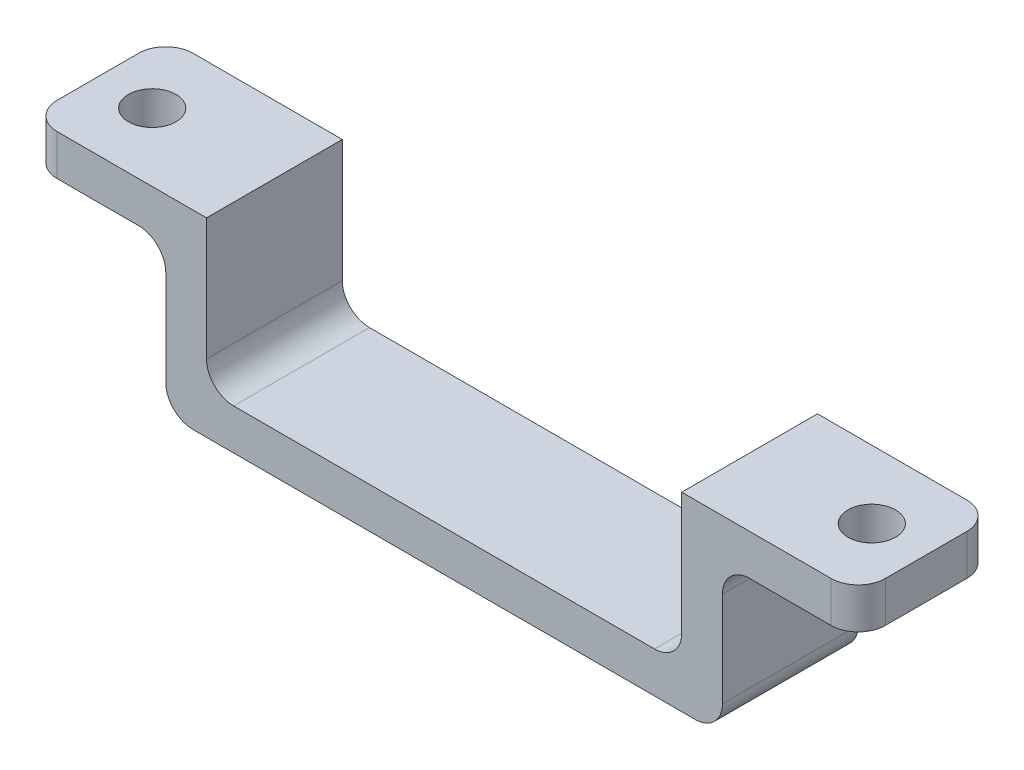
ISO-10303-21;
HEADER;
FILE_DESCRIPTION(('STEP AP214'),'2;1');
FILE_NAME('part.step','',(''),(''),'','','');
FILE_SCHEMA(('AUTOMOTIVE_DESIGN { 1 0 10303 214 1 1 1 1 }'));
ENDSEC;
DATA;
#1=APPLICATION_CONTEXT('core data for automotive mechanical design processes');
#2=APPLICATION_PROTOCOL_DEFINITION('international standard','automotive_design',2000,#1);
#3=PRODUCT_CONTEXT('',#1,'mechanical');
#4=PRODUCT('Part','Part','',(#3));
#5=PRODUCT_RELATED_PRODUCT_CATEGORY('part','',(#4));
#6=PRODUCT_DEFINITION_FORMATION('','',#4);
#7=PRODUCT_DEFINITION_CONTEXT('part definition',#1,'design');
#8=PRODUCT_DEFINITION('design','',#6,#7);
#9=PRODUCT_DEFINITION_SHAPE('','',#8);
#10=(LENGTH_UNIT() NAMED_UNIT(*) SI_UNIT(.MILLI.,.METRE.));
#11=(NAMED_UNIT(*) PLANE_ANGLE_UNIT() SI_UNIT($,.RADIAN.));
#12=(NAMED_UNIT(*) SI_UNIT($,.STERADIAN.) SOLID_ANGLE_UNIT());
#13=UNCERTAINTY_MEASURE_WITH_UNIT(LENGTH_MEASURE(1.E-05),#10,'distance_accuracy_value','');
#14=(GEOMETRIC_REPRESENTATION_CONTEXT(3) GLOBAL_UNCERTAINTY_ASSIGNED_CONTEXT((#13)) GLOBAL_UNIT_ASSIGNED_CONTEXT((#10,
#11,#12)) REPRESENTATION_CONTEXT('',''));
#15=CARTESIAN_POINT('',(0.,0.,0.));
#16=DIRECTION('',(0.,0.,1.));
#17=DIRECTION('',(1.,0.,0.));
#18=AXIS2_PLACEMENT_3D('',#15,#16,#17);
#19=CARTESIAN_POINT('',(17.5,-3.,5.));
#20=DIRECTION('',(0.,1.,0.));
#21=DIRECTION('',(-1.,0.,0.));
#22=AXIS2_PLACEMENT_3D('',#19,#20,#21);
#23=PLANE('',#22);
#24=CARTESIAN_POINT('',(26.5,-3.,0.));
#25=DIRECTION('',(0.,-1.,0.));
#26=DIRECTION('',(0.,0.,-1.));
#27=AXIS2_PLACEMENT_3D('',#24,#25,#26);
#28=CIRCLE('',#27,1.75);
#29=CARTESIAN_POINT('',(26.5,-3.,-1.75));
#30=VERTEX_POINT('',#29);
#31=EDGE_CURVE('E657',#30,#30,#28,.T.);
#32=ORIENTED_EDGE('',*,*,#31,.F.);
#33=EDGE_LOOP('',(#32));
#34=FACE_BOUND('',#33,.T.);
#35=DIRECTION('',(0.,0.,-1.));
#36=VECTOR('',#35,1.);
#37=CARTESIAN_POINT('',(30.5,-3.,5.));
#38=LINE('',#37,#36);
#39=CARTESIAN_POINT('',(30.5,-3.,3.));
#40=VERTEX_POINT('',#39);
#41=CARTESIAN_POINT('',(30.5,-3.,-3.));
#42=VERTEX_POINT('',#41);
#43=EDGE_CURVE('E266',#40,#42,#38,.T.);
#44=ORIENTED_EDGE('',*,*,#43,.F.);
#45=CARTESIAN_POINT('',(28.5,-3.,3.));
#46=DIRECTION('',(0.,1.,0.));
#47=DIRECTION('',(-1.,0.,0.));
#48=AXIS2_PLACEMENT_3D('',#45,#46,#47);
#49=CIRCLE('',#48,2.);
#50=CARTESIAN_POINT('',(28.5,-3.,5.));
#51=VERTEX_POINT('',#50);
#52=EDGE_CURVE('E331',#40,#51,#49,.F.);
#53=ORIENTED_EDGE('',*,*,#52,.T.);
#54=DIRECTION('',(1.,0.,0.));
#55=VECTOR('',#54,1.);
#56=CARTESIAN_POINT('',(17.5,-3.,5.));
#57=LINE('',#56,#55);
#58=CARTESIAN_POINT('',(22.5,-3.,5.));
#59=VERTEX_POINT('',#58);
#60=EDGE_CURVE('E209',#59,#51,#57,.T.);
#61=ORIENTED_EDGE('',*,*,#60,.F.);
#62=DIRECTION('',(0.,0.,-1.));
#63=VECTOR('',#62,1.);
#64=CARTESIAN_POINT('',(22.5,-3.,-5.));
#65=LINE('',#64,#63);
#66=CARTESIAN_POINT('',(22.5,-3.,-5.));
#67=VERTEX_POINT('',#66);
#68=EDGE_CURVE('E277',#59,#67,#65,.T.);
#69=ORIENTED_EDGE('',*,*,#68,.T.);
#70=DIRECTION('',(1.,0.,0.));
#71=VECTOR('',#70,1.);
#72=CARTESIAN_POINT('',(17.5,-3.,-5.));
#73=LINE('',#72,#71);
#74=CARTESIAN_POINT('',(28.5,-3.,-5.));
#75=VERTEX_POINT('',#74);
#76=EDGE_CURVE('E234',#67,#75,#73,.T.);
#77=ORIENTED_EDGE('',*,*,#76,.T.);
#78=CARTESIAN_POINT('',(28.5,-3.,-3.));
#79=DIRECTION('',(0.,1.,0.));
#80=DIRECTION('',(-1.,0.,0.));
#81=AXIS2_PLACEMENT_3D('',#78,#79,#80);
#82=CIRCLE('',#81,2.);
#83=EDGE_CURVE('E329',#75,#42,#82,.F.);
#84=ORIENTED_EDGE('',*,*,#83,.T.);
#85=EDGE_LOOP('',(#44,#53,#61,#69,#77,#84));
#86=FACE_BOUND('',#85,.T.);
#87=ADVANCED_FACE('F33',(#34,#86),#23,.F.);
#88=CARTESIAN_POINT('',(30.5,0.,5.));
#89=DIRECTION('',(1.,0.,0.));
#90=DIRECTION('',(0.,0.,-1.));
#91=AXIS2_PLACEMENT_3D('',#88,#89,#90);
#92=PLANE('',#91);
#93=DIRECTION('',(0.,0.,-1.));
#94=VECTOR('',#93,1.);
#95=CARTESIAN_POINT('',(30.5,0.,5.));
#96=LINE('',#95,#94);
#97=CARTESIAN_POINT('',(30.5,0.,3.));
#98=VERTEX_POINT('',#97);
#99=CARTESIAN_POINT('',(30.5,0.,-3.));
#100=VERTEX_POINT('',#99);
#101=EDGE_CURVE('E202',#98,#100,#96,.T.);
#102=ORIENTED_EDGE('',*,*,#101,.F.);
#103=DIRECTION('',(0.,-1.,0.));
#104=VECTOR('',#103,1.);
#105=CARTESIAN_POINT('',(30.5,-3.,3.));
#106=LINE('',#105,#104);
#107=EDGE_CURVE('E326',#98,#40,#106,.T.);
#108=ORIENTED_EDGE('',*,*,#107,.T.);
#109=ORIENTED_EDGE('',*,*,#43,.T.);
#110=DIRECTION('',(0.,-1.,0.));
#111=VECTOR('',#110,1.);
#112=CARTESIAN_POINT('',(30.5,0.,-3.));
#113=LINE('',#112,#111);
#114=EDGE_CURVE('E324',#42,#100,#113,.F.);
#115=ORIENTED_EDGE('',*,*,#114,.T.);
#116=EDGE_LOOP('',(#102,#108,#109,#115));
#117=FACE_BOUND('',#116,.T.);
#118=ADVANCED_FACE('F410',(#117),#92,.T.);
#119=CARTESIAN_POINT('',(17.5,0.,5.));
#120=DIRECTION('',(0.,1.,0.));
#121=DIRECTION('',(-1.,0.,0.));
#122=AXIS2_PLACEMENT_3D('',#119,#120,#121);
#123=PLANE('',#122);
#124=CARTESIAN_POINT('',(26.5,0.,0.));
#125=DIRECTION('',(0.,-1.,0.));
#126=DIRECTION('',(0.,0.,-1.));
#127=AXIS2_PLACEMENT_3D('',#124,#125,#126);
#128=CIRCLE('',#127,1.75);
#129=CARTESIAN_POINT('',(26.5,0.,-1.75));
#130=VERTEX_POINT('',#129);
#131=EDGE_CURVE('E237',#130,#130,#128,.T.);
#132=ORIENTED_EDGE('',*,*,#131,.T.);
#133=EDGE_LOOP('',(#132));
#134=FACE_BOUND('',#133,.T.);
#135=DIRECTION('',(1.,0.,0.));
#136=VECTOR('',#135,1.);
#137=CARTESIAN_POINT('',(17.5,0.,5.));
#138=LINE('',#137,#136);
#139=CARTESIAN_POINT('',(17.5,0.,5.));
#140=VERTEX_POINT('',#139);
#141=CARTESIAN_POINT('',(28.5,0.,5.));
#142=VERTEX_POINT('',#141);
#143=EDGE_CURVE('E194',#140,#142,#138,.T.);
#144=ORIENTED_EDGE('',*,*,#143,.T.);
#145=CARTESIAN_POINT('',(28.5,0.,3.));
#146=DIRECTION('',(0.,1.,0.));
#147=DIRECTION('',(-1.,0.,0.));
#148=AXIS2_PLACEMENT_3D('',#145,#146,#147);
#149=CIRCLE('',#148,2.);
#150=EDGE_CURVE('E338',#142,#98,#149,.T.);
#151=ORIENTED_EDGE('',*,*,#150,.T.);
#152=ORIENTED_EDGE('',*,*,#101,.T.);
#153=CARTESIAN_POINT('',(28.5,0.,-3.));
#154=DIRECTION('',(0.,1.,0.));
#155=DIRECTION('',(-1.,0.,0.));
#156=AXIS2_PLACEMENT_3D('',#153,#154,#155);
#157=CIRCLE('',#156,2.);
#158=CARTESIAN_POINT('',(28.5,0.,-5.));
#159=VERTEX_POINT('',#158);
#160=EDGE_CURVE('E336',#100,#159,#157,.T.);
#161=ORIENTED_EDGE('',*,*,#160,.T.);
#162=DIRECTION('',(1.,0.,0.));
#163=VECTOR('',#162,1.);
#164=CARTESIAN_POINT('',(17.5,0.,-5.));
#165=LINE('',#164,#163);
#166=CARTESIAN_POINT('',(17.5,0.,-5.));
#167=VERTEX_POINT('',#166);
#168=EDGE_CURVE('E201',#167,#159,#165,.T.);
#169=ORIENTED_EDGE('',*,*,#168,.F.);
#170=DIRECTION('',(0.,0.,-1.));
#171=VECTOR('',#170,1.);
#172=CARTESIAN_POINT('',(17.5,0.,5.));
#173=LINE('',#172,#171);
#174=EDGE_CURVE('E186',#140,#167,#173,.T.);
#175=ORIENTED_EDGE('',*,*,#174,.F.);
#176=EDGE_LOOP('',(#144,#151,#152,#161,#169,#175));
#177=FACE_BOUND('',#176,.T.);
#178=ADVANCED_FACE('F198',(#134,#177),#123,.T.);
#179=CARTESIAN_POINT('',(17.5,-11.,5.));
#180=DIRECTION('',(-1.,0.,0.));
#181=DIRECTION('',(0.,0.,1.));
#182=AXIS2_PLACEMENT_3D('',#179,#180,#181);
#183=PLANE('',#182);
#184=DIRECTION('',(0.,1.,0.));
#185=VECTOR('',#184,1.);
#186=CARTESIAN_POINT('',(17.5,-11.,-5.));
#187=LINE('',#186,#185);
#188=CARTESIAN_POINT('',(17.5,-9.,-5.));
#189=VERTEX_POINT('',#188);
#190=EDGE_CURVE('E239',#189,#167,#187,.T.);
#191=ORIENTED_EDGE('',*,*,#190,.F.);
#192=DIRECTION('',(0.,0.,-1.));
#193=VECTOR('',#192,1.);
#194=CARTESIAN_POINT('',(17.5,-9.,5.));
#195=LINE('',#194,#193);
#196=CARTESIAN_POINT('',(17.5,-9.,5.));
#197=VERTEX_POINT('',#196);
#198=EDGE_CURVE('E189',#189,#197,#195,.F.);
#199=ORIENTED_EDGE('',*,*,#198,.T.);
#200=DIRECTION('',(0.,1.,0.));
#201=VECTOR('',#200,1.);
#202=CARTESIAN_POINT('',(17.5,-11.,5.));
#203=LINE('',#202,#201);
#204=EDGE_CURVE('E182',#197,#140,#203,.T.);
#205=ORIENTED_EDGE('',*,*,#204,.T.);
#206=ORIENTED_EDGE('',*,*,#174,.T.);
#207=EDGE_LOOP('',(#191,#199,#205,#206));
#208=FACE_BOUND('',#207,.T.);
#209=ADVANCED_FACE('F185',(#208),#183,.T.);
#210=CARTESIAN_POINT('',(-17.5,-11.,5.));
#211=DIRECTION('',(0.,1.,0.));
#212=DIRECTION('',(-1.,0.,0.));
#213=AXIS2_PLACEMENT_3D('',#210,#211,#212);
#214=PLANE('',#213);
#215=DIRECTION('',(1.,0.,0.));
#216=VECTOR('',#215,1.);
#217=CARTESIAN_POINT('',(-17.5,-11.,5.));
#218=LINE('',#217,#216);
#219=CARTESIAN_POINT('',(-15.5,-11.,5.));
#220=VERTEX_POINT('',#219);
#221=CARTESIAN_POINT('',(15.5,-11.,5.));
#222=VERTEX_POINT('',#221);
#223=EDGE_CURVE('E193',#220,#222,#218,.T.);
#224=ORIENTED_EDGE('',*,*,#223,.T.);
#225=DIRECTION('',(0.,0.,-1.));
#226=VECTOR('',#225,1.);
#227=CARTESIAN_POINT('',(15.5,-11.,-5.));
#228=LINE('',#227,#226);
#229=CARTESIAN_POINT('',(15.5,-11.,-5.));
#230=VERTEX_POINT('',#229);
#231=EDGE_CURVE('E300',#222,#230,#228,.T.);
#232=ORIENTED_EDGE('',*,*,#231,.T.);
#233=DIRECTION('',(1.,0.,0.));
#234=VECTOR('',#233,1.);
#235=CARTESIAN_POINT('',(-17.5,-11.,-5.));
#236=LINE('',#235,#234);
#237=CARTESIAN_POINT('',(-15.5,-11.,-5.));
#238=VERTEX_POINT('',#237);
#239=EDGE_CURVE('E241',#238,#230,#236,.T.);
#240=ORIENTED_EDGE('',*,*,#239,.F.);
#241=DIRECTION('',(0.,0.,-1.));
#242=VECTOR('',#241,1.);
#243=CARTESIAN_POINT('',(-15.5,-11.,5.));
#244=LINE('',#243,#242);
#245=EDGE_CURVE('E298',#238,#220,#244,.F.);
#246=ORIENTED_EDGE('',*,*,#245,.T.);
#247=EDGE_LOOP('',(#224,#232,#240,#246));
#248=FACE_BOUND('',#247,.T.);
#249=ADVANCED_FACE('F422',(#248),#214,.T.);
#250=CARTESIAN_POINT('',(-17.5,0.,5.));
#251=DIRECTION('',(1.,0.,0.));
#252=DIRECTION('',(0.,0.,-1.));
#253=AXIS2_PLACEMENT_3D('',#250,#251,#252);
#254=PLANE('',#253);
#255=DIRECTION('',(0.,-1.,0.));
#256=VECTOR('',#255,1.);
#257=CARTESIAN_POINT('',(-17.5,0.,5.));
#258=LINE('',#257,#256);
#259=CARTESIAN_POINT('',(-17.5,0.,5.));
#260=VERTEX_POINT('',#259);
#261=CARTESIAN_POINT('',(-17.5,-9.,5.));
#262=VERTEX_POINT('',#261);
#263=EDGE_CURVE('E217',#260,#262,#258,.T.);
#264=ORIENTED_EDGE('',*,*,#263,.T.);
#265=DIRECTION('',(0.,0.,-1.));
#266=VECTOR('',#265,1.);
#267=CARTESIAN_POINT('',(-17.5,-9.,-5.));
#268=LINE('',#267,#266);
#269=CARTESIAN_POINT('',(-17.5,-9.,-5.));
#270=VERTEX_POINT('',#269);
#271=EDGE_CURVE('E304',#262,#270,#268,.T.);
#272=ORIENTED_EDGE('',*,*,#271,.T.);
#273=DIRECTION('',(0.,-1.,0.));
#274=VECTOR('',#273,1.);
#275=CARTESIAN_POINT('',(-17.5,0.,-5.));
#276=LINE('',#275,#274);
#277=CARTESIAN_POINT('',(-17.5,0.,-5.));
#278=VERTEX_POINT('',#277);
#279=EDGE_CURVE('E244',#278,#270,#276,.T.);
#280=ORIENTED_EDGE('',*,*,#279,.F.);
#281=DIRECTION('',(0.,0.,-1.));
#282=VECTOR('',#281,1.);
#283=CARTESIAN_POINT('',(-17.5,0.,5.));
#284=LINE('',#283,#282);
#285=EDGE_CURVE('E203',#260,#278,#284,.T.);
#286=ORIENTED_EDGE('',*,*,#285,.F.);
#287=EDGE_LOOP('',(#264,#272,#280,#286));
#288=FACE_BOUND('',#287,.T.);
#289=ADVANCED_FACE('F431',(#288),#254,.T.);
#290=CARTESIAN_POINT('',(-30.5,0.,5.));
#291=DIRECTION('',(0.,1.,0.));
#292=DIRECTION('',(-1.,0.,0.));
#293=AXIS2_PLACEMENT_3D('',#290,#291,#292);
#294=PLANE('',#293);
#295=CARTESIAN_POINT('',(-26.5,0.,0.));
#296=DIRECTION('',(0.,-1.,0.));
#297=DIRECTION('',(0.,0.,-1.));
#298=AXIS2_PLACEMENT_3D('',#295,#296,#297);
#299=CIRCLE('',#298,1.75);
#300=CARTESIAN_POINT('',(-26.5,0.,-1.75000000000001));
#301=VERTEX_POINT('',#300);
#302=EDGE_CURVE('E652',#301,#301,#299,.T.);
#303=ORIENTED_EDGE('',*,*,#302,.T.);
#304=EDGE_LOOP('',(#303));
#305=FACE_BOUND('',#304,.T.);
#306=DIRECTION('',(1.,0.,0.));
#307=VECTOR('',#306,1.);
#308=CARTESIAN_POINT('',(-30.5,0.,-5.));
#309=LINE('',#308,#307);
#310=CARTESIAN_POINT('',(-28.5,0.,-5.));
#311=VERTEX_POINT('',#310);
#312=EDGE_CURVE('E247',#311,#278,#309,.T.);
#313=ORIENTED_EDGE('',*,*,#312,.F.);
#314=CARTESIAN_POINT('',(-28.5,0.,-3.));
#315=DIRECTION('',(0.,1.,0.));
#316=DIRECTION('',(-1.,0.,0.));
#317=AXIS2_PLACEMENT_3D('',#314,#315,#316);
#318=CIRCLE('',#317,2.);
#319=CARTESIAN_POINT('',(-30.5,0.,-3.));
#320=VERTEX_POINT('',#319);
#321=EDGE_CURVE('E348',#311,#320,#318,.T.);
#322=ORIENTED_EDGE('',*,*,#321,.T.);
#323=DIRECTION('',(0.,0.,-1.));
#324=VECTOR('',#323,1.);
#325=CARTESIAN_POINT('',(-30.5,0.,5.));
#326=LINE('',#325,#324);
#327=CARTESIAN_POINT('',(-30.5,0.,3.));
#328=VERTEX_POINT('',#327);
#329=EDGE_CURVE('E260',#328,#320,#326,.T.);
#330=ORIENTED_EDGE('',*,*,#329,.F.);
#331=CARTESIAN_POINT('',(-28.5,0.,3.));
#332=DIRECTION('',(0.,1.,0.));
#333=DIRECTION('',(-1.,0.,0.));
#334=AXIS2_PLACEMENT_3D('',#331,#332,#333);
#335=CIRCLE('',#334,2.);
#336=CARTESIAN_POINT('',(-28.5,0.,5.));
#337=VERTEX_POINT('',#336);
#338=EDGE_CURVE('E346',#328,#337,#335,.T.);
#339=ORIENTED_EDGE('',*,*,#338,.T.);
#340=DIRECTION('',(1.,0.,0.));
#341=VECTOR('',#340,1.);
#342=CARTESIAN_POINT('',(-30.5,0.,5.));
#343=LINE('',#342,#341);
#344=EDGE_CURVE('E220',#337,#260,#343,.T.);
#345=ORIENTED_EDGE('',*,*,#344,.T.);
#346=ORIENTED_EDGE('',*,*,#285,.T.);
#347=EDGE_LOOP('',(#313,#322,#330,#339,#345,#346));
#348=FACE_BOUND('',#347,.T.);
#349=ADVANCED_FACE('F359',(#305,#348),#294,.T.);
#350=CARTESIAN_POINT('',(-30.5,-3.,5.));
#351=DIRECTION('',(-1.,0.,0.));
#352=DIRECTION('',(0.,0.,1.));
#353=AXIS2_PLACEMENT_3D('',#350,#351,#352);
#354=PLANE('',#353);
#355=ORIENTED_EDGE('',*,*,#329,.T.);
#356=DIRECTION('',(0.,1.,0.));
#357=VECTOR('',#356,1.);
#358=CARTESIAN_POINT('',(-30.5,-3.,-3.));
#359=LINE('',#358,#357);
#360=CARTESIAN_POINT('',(-30.5,-3.,-3.));
#361=VERTEX_POINT('',#360);
#362=EDGE_CURVE('E48',#320,#361,#359,.F.);
#363=ORIENTED_EDGE('',*,*,#362,.T.);
#364=DIRECTION('',(0.,0.,-1.));
#365=VECTOR('',#364,1.);
#366=CARTESIAN_POINT('',(-30.5,-3.,5.));
#367=LINE('',#366,#365);
#368=CARTESIAN_POINT('',(-30.5,-3.,3.));
#369=VERTEX_POINT('',#368);
#370=EDGE_CURVE('E233',#369,#361,#367,.T.);
#371=ORIENTED_EDGE('',*,*,#370,.F.);
#372=DIRECTION('',(0.,1.,0.));
#373=VECTOR('',#372,1.);
#374=CARTESIAN_POINT('',(-30.5,0.,3.));
#375=LINE('',#374,#373);
#376=EDGE_CURVE('E350',#369,#328,#375,.T.);
#377=ORIENTED_EDGE('',*,*,#376,.T.);
#378=EDGE_LOOP('',(#355,#363,#371,#377));
#379=FACE_BOUND('',#378,.T.);
#380=ADVANCED_FACE('F355',(#379),#354,.T.);
#381=CARTESIAN_POINT('',(-30.5,-3.,5.));
#382=DIRECTION('',(0.,1.,0.));
#383=DIRECTION('',(-1.,0.,0.));
#384=AXIS2_PLACEMENT_3D('',#381,#382,#383);
#385=PLANE('',#384);
#386=CARTESIAN_POINT('',(-26.5,-3.,0.));
#387=DIRECTION('',(0.,-1.,0.));
#388=DIRECTION('',(0.,0.,-1.));
#389=AXIS2_PLACEMENT_3D('',#386,#387,#388);
#390=CIRCLE('',#389,1.75);
#391=CARTESIAN_POINT('',(-26.5,-3.,-1.75000000000001));
#392=VERTEX_POINT('',#391);
#393=EDGE_CURVE('E655',#392,#392,#390,.T.);
#394=ORIENTED_EDGE('',*,*,#393,.F.);
#395=EDGE_LOOP('',(#394));
#396=FACE_BOUND('',#395,.T.);
#397=ORIENTED_EDGE('',*,*,#370,.T.);
#398=CARTESIAN_POINT('',(-28.5,-3.,-3.));
#399=DIRECTION('',(0.,1.,0.));
#400=DIRECTION('',(-1.,0.,0.));
#401=AXIS2_PLACEMENT_3D('',#398,#399,#400);
#402=CIRCLE('',#401,2.);
#403=CARTESIAN_POINT('',(-28.5,-3.,-5.));
#404=VERTEX_POINT('',#403);
#405=EDGE_CURVE('E11',#361,#404,#402,.F.);
#406=ORIENTED_EDGE('',*,*,#405,.T.);
#407=DIRECTION('',(1.,0.,0.));
#408=VECTOR('',#407,1.);
#409=CARTESIAN_POINT('',(-30.5,-3.,-5.));
#410=LINE('',#409,#408);
#411=CARTESIAN_POINT('',(-22.5,-3.,-5.));
#412=VERTEX_POINT('',#411);
#413=EDGE_CURVE('E249',#404,#412,#410,.T.);
#414=ORIENTED_EDGE('',*,*,#413,.T.);
#415=DIRECTION('',(0.,0.,-1.));
#416=VECTOR('',#415,1.);
#417=CARTESIAN_POINT('',(-22.5,-3.,5.));
#418=LINE('',#417,#416);
#419=CARTESIAN_POINT('',(-22.5,-3.,5.));
#420=VERTEX_POINT('',#419);
#421=EDGE_CURVE('E274',#412,#420,#418,.F.);
#422=ORIENTED_EDGE('',*,*,#421,.T.);
#423=DIRECTION('',(1.,0.,0.));
#424=VECTOR('',#423,1.);
#425=CARTESIAN_POINT('',(-30.5,-3.,5.));
#426=LINE('',#425,#424);
#427=CARTESIAN_POINT('',(-28.5,-3.,5.));
#428=VERTEX_POINT('',#427);
#429=EDGE_CURVE('E222',#428,#420,#426,.T.);
#430=ORIENTED_EDGE('',*,*,#429,.F.);
#431=CARTESIAN_POINT('',(-28.5,-3.,3.));
#432=DIRECTION('',(0.,1.,0.));
#433=DIRECTION('',(-1.,0.,0.));
#434=AXIS2_PLACEMENT_3D('',#431,#432,#433);
#435=CIRCLE('',#434,2.);
#436=EDGE_CURVE('E41',#428,#369,#435,.F.);
#437=ORIENTED_EDGE('',*,*,#436,.T.);
#438=EDGE_LOOP('',(#397,#406,#414,#422,#430,#437));
#439=FACE_BOUND('',#438,.T.);
#440=ADVANCED_FACE('F370',(#396,#439),#385,.F.);
#441=CARTESIAN_POINT('',(-20.5,0.,5.));
#442=DIRECTION('',(1.,0.,0.));
#443=DIRECTION('',(0.,0.,-1.));
#444=AXIS2_PLACEMENT_3D('',#441,#442,#443);
#445=PLANE('',#444);
#446=DIRECTION('',(0.,1.,0.));
#447=VECTOR('',#446,1.);
#448=CARTESIAN_POINT('',(-20.5,0.,5.));
#449=LINE('',#448,#447);
#450=CARTESIAN_POINT('',(-20.5,-5.,5.));
#451=VERTEX_POINT('',#450);
#452=CARTESIAN_POINT('',(-20.5,-12.,5.));
#453=VERTEX_POINT('',#452);
#454=EDGE_CURVE('E224',#451,#453,#449,.F.);
#455=ORIENTED_EDGE('',*,*,#454,.F.);
#456=DIRECTION('',(0.,0.,-1.));
#457=VECTOR('',#456,1.);
#458=CARTESIAN_POINT('',(-20.5,-5.,-5.));
#459=LINE('',#458,#457);
#460=CARTESIAN_POINT('',(-20.5,-5.,-5.));
#461=VERTEX_POINT('',#460);
#462=EDGE_CURVE('E271',#451,#461,#459,.T.);
#463=ORIENTED_EDGE('',*,*,#462,.T.);
#464=DIRECTION('',(0.,1.,0.));
#465=VECTOR('',#464,1.);
#466=CARTESIAN_POINT('',(-20.5,0.,-5.));
#467=LINE('',#466,#465);
#468=CARTESIAN_POINT('',(-20.5,-12.,-5.));
#469=VERTEX_POINT('',#468);
#470=EDGE_CURVE('E251',#461,#469,#467,.F.);
#471=ORIENTED_EDGE('',*,*,#470,.T.);
#472=DIRECTION('',(0.,0.,-1.));
#473=VECTOR('',#472,1.);
#474=CARTESIAN_POINT('',(-20.5,-12.,5.));
#475=LINE('',#474,#473);
#476=EDGE_CURVE('E269',#469,#453,#475,.F.);
#477=ORIENTED_EDGE('',*,*,#476,.T.);
#478=EDGE_LOOP('',(#455,#463,#471,#477));
#479=FACE_BOUND('',#478,.T.);
#480=ADVANCED_FACE('F378',(#479),#445,.F.);
#481=CARTESIAN_POINT('',(-17.5,-14.,5.));
#482=DIRECTION('',(0.,1.,0.));
#483=DIRECTION('',(-1.,0.,0.));
#484=AXIS2_PLACEMENT_3D('',#481,#482,#483);
#485=PLANE('',#484);
#486=DIRECTION('',(1.,0.,0.));
#487=VECTOR('',#486,1.);
#488=CARTESIAN_POINT('',(-17.5,-14.,-5.));
#489=LINE('',#488,#487);
#490=CARTESIAN_POINT('',(-18.5,-14.,-5.));
#491=VERTEX_POINT('',#490);
#492=CARTESIAN_POINT('',(18.5,-14.,-5.));
#493=VERTEX_POINT('',#492);
#494=EDGE_CURVE('E254',#491,#493,#489,.T.);
#495=ORIENTED_EDGE('',*,*,#494,.T.);
#496=DIRECTION('',(0.,0.,-1.));
#497=VECTOR('',#496,1.);
#498=CARTESIAN_POINT('',(18.5,-14.,5.));
#499=LINE('',#498,#497);
#500=CARTESIAN_POINT('',(18.5,-14.,5.));
#501=VERTEX_POINT('',#500);
#502=EDGE_CURVE('E292',#493,#501,#499,.F.);
#503=ORIENTED_EDGE('',*,*,#502,.T.);
#504=DIRECTION('',(1.,0.,0.));
#505=VECTOR('',#504,1.);
#506=CARTESIAN_POINT('',(-17.5,-14.,5.));
#507=LINE('',#506,#505);
#508=CARTESIAN_POINT('',(-18.5,-14.,5.));
#509=VERTEX_POINT('',#508);
#510=EDGE_CURVE('E227',#509,#501,#507,.T.);
#511=ORIENTED_EDGE('',*,*,#510,.F.);
#512=DIRECTION('',(0.,0.,-1.));
#513=VECTOR('',#512,1.);
#514=CARTESIAN_POINT('',(-18.5,-14.,5.));
#515=LINE('',#514,#513);
#516=EDGE_CURVE('E289',#509,#491,#515,.T.);
#517=ORIENTED_EDGE('',*,*,#516,.T.);
#518=EDGE_LOOP('',(#495,#503,#511,#517));
#519=FACE_BOUND('',#518,.T.);
#520=ADVANCED_FACE('F386',(#519),#485,.F.);
#521=CARTESIAN_POINT('',(20.5,-11.,5.));
#522=DIRECTION('',(-1.,0.,0.));
#523=DIRECTION('',(0.,0.,1.));
#524=AXIS2_PLACEMENT_3D('',#521,#522,#523);
#525=PLANE('',#524);
#526=DIRECTION('',(0.,1.,0.));
#527=VECTOR('',#526,1.);
#528=CARTESIAN_POINT('',(20.5,-11.,-5.));
#529=LINE('',#528,#527);
#530=CARTESIAN_POINT('',(20.5,-12.,-5.));
#531=VERTEX_POINT('',#530);
#532=CARTESIAN_POINT('',(20.5,-5.,-5.));
#533=VERTEX_POINT('',#532);
#534=EDGE_CURVE('E211',#531,#533,#529,.T.);
#535=ORIENTED_EDGE('',*,*,#534,.T.);
#536=DIRECTION('',(0.,0.,-1.));
#537=VECTOR('',#536,1.);
#538=CARTESIAN_POINT('',(20.5,-5.,5.));
#539=LINE('',#538,#537);
#540=CARTESIAN_POINT('',(20.5,-5.,5.));
#541=VERTEX_POINT('',#540);
#542=EDGE_CURVE('E283',#533,#541,#539,.F.);
#543=ORIENTED_EDGE('',*,*,#542,.T.);
#544=DIRECTION('',(0.,1.,0.));
#545=VECTOR('',#544,1.);
#546=CARTESIAN_POINT('',(20.5,-11.,5.));
#547=LINE('',#546,#545);
#548=CARTESIAN_POINT('',(20.5,-12.,5.));
#549=VERTEX_POINT('',#548);
#550=EDGE_CURVE('E230',#549,#541,#547,.T.);
#551=ORIENTED_EDGE('',*,*,#550,.F.);
#552=DIRECTION('',(0.,0.,-1.));
#553=VECTOR('',#552,1.);
#554=CARTESIAN_POINT('',(20.5,-12.,5.));
#555=LINE('',#554,#553);
#556=EDGE_CURVE('E280',#549,#531,#555,.T.);
#557=ORIENTED_EDGE('',*,*,#556,.T.);
#558=EDGE_LOOP('',(#535,#543,#551,#557));
#559=FACE_BOUND('',#558,.T.);
#560=ADVANCED_FACE('F395',(#559),#525,.F.);
#561=CARTESIAN_POINT('',(0.,0.,5.));
#562=DIRECTION('',(0.,0.,-1.));
#563=DIRECTION('',(-1.,0.,0.));
#564=AXIS2_PLACEMENT_3D('',#561,#562,#563);
#565=PLANE('',#564);
#566=ORIENTED_EDGE('',*,*,#60,.T.);
#567=DIRECTION('',(0.,-1.,0.));
#568=VECTOR('',#567,1.);
#569=CARTESIAN_POINT('',(28.5,0.,5.));
#570=LINE('',#569,#568);
#571=EDGE_CURVE('E208',#51,#142,#570,.F.);
#572=ORIENTED_EDGE('',*,*,#571,.T.);
#573=ORIENTED_EDGE('',*,*,#143,.F.);
#574=ORIENTED_EDGE('',*,*,#204,.F.);
#575=CARTESIAN_POINT('',(15.5,-9.,5.));
#576=DIRECTION('',(0.,0.,-1.));
#577=DIRECTION('',(-1.,0.,0.));
#578=AXIS2_PLACEMENT_3D('',#575,#576,#577);
#579=CIRCLE('',#578,2.);
#580=EDGE_CURVE('E318',#197,#222,#579,.T.);
#581=ORIENTED_EDGE('',*,*,#580,.T.);
#582=ORIENTED_EDGE('',*,*,#223,.F.);
#583=CARTESIAN_POINT('',(-15.5,-9.,5.));
#584=DIRECTION('',(0.,0.,-1.));
#585=DIRECTION('',(-1.,0.,0.));
#586=AXIS2_PLACEMENT_3D('',#583,#584,#585);
#587=CIRCLE('',#586,2.);
#588=EDGE_CURVE('E322',#220,#262,#587,.T.);
#589=ORIENTED_EDGE('',*,*,#588,.T.);
#590=ORIENTED_EDGE('',*,*,#263,.F.);
#591=ORIENTED_EDGE('',*,*,#344,.F.);
#592=DIRECTION('',(0.,1.,0.));
#593=VECTOR('',#592,1.);
#594=CARTESIAN_POINT('',(-28.5,-3.,5.));
#595=LINE('',#594,#593);
#596=EDGE_CURVE('E333',#337,#428,#595,.F.);
#597=ORIENTED_EDGE('',*,*,#596,.T.);
#598=ORIENTED_EDGE('',*,*,#429,.T.);
#599=CARTESIAN_POINT('',(-22.5,-5.,5.));
#600=DIRECTION('',(0.,0.,-1.));
#601=DIRECTION('',(-1.,0.,0.));
#602=AXIS2_PLACEMENT_3D('',#599,#600,#601);
#603=CIRCLE('',#602,2.);
#604=EDGE_CURVE('E310',#420,#451,#603,.T.);
#605=ORIENTED_EDGE('',*,*,#604,.T.);
#606=ORIENTED_EDGE('',*,*,#454,.T.);
#607=CARTESIAN_POINT('',(-18.5,-12.,5.));
#608=DIRECTION('',(0.,0.,-1.));
#609=DIRECTION('',(-1.,0.,0.));
#610=AXIS2_PLACEMENT_3D('',#607,#608,#609);
#611=CIRCLE('',#610,2.);
#612=EDGE_CURVE('E294',#453,#509,#611,.F.);
#613=ORIENTED_EDGE('',*,*,#612,.T.);
#614=ORIENTED_EDGE('',*,*,#510,.T.);
#615=CARTESIAN_POINT('',(18.5,-12.,5.));
#616=DIRECTION('',(0.,0.,-1.));
#617=DIRECTION('',(-1.,0.,0.));
#618=AXIS2_PLACEMENT_3D('',#615,#616,#617);
#619=CIRCLE('',#618,2.);
#620=EDGE_CURVE('E296',#501,#549,#619,.F.);
#621=ORIENTED_EDGE('',*,*,#620,.T.);
#622=ORIENTED_EDGE('',*,*,#550,.T.);
#623=CARTESIAN_POINT('',(22.5,-5.,5.));
#624=DIRECTION('',(0.,0.,-1.));
#625=DIRECTION('',(-1.,0.,0.));
#626=AXIS2_PLACEMENT_3D('',#623,#624,#625);
#627=CIRCLE('',#626,2.);
#628=EDGE_CURVE('E314',#541,#59,#627,.T.);
#629=ORIENTED_EDGE('',*,*,#628,.T.);
#630=EDGE_LOOP('',(#566,#572,#573,#574,#581,#582,#589,#590,#591,#597,#598,#605,#606,#613,#614,
#621,#622,#629));
#631=FACE_BOUND('',#630,.T.);
#632=ADVANCED_FACE('F206',(#631),#565,.F.);
#633=CARTESIAN_POINT('',(0.,0.,-5.));
#634=DIRECTION('',(0.,0.,-1.));
#635=DIRECTION('',(-1.,0.,0.));
#636=AXIS2_PLACEMENT_3D('',#633,#634,#635);
#637=PLANE('',#636);
#638=ORIENTED_EDGE('',*,*,#168,.T.);
#639=DIRECTION('',(0.,-1.,0.));
#640=VECTOR('',#639,1.);
#641=CARTESIAN_POINT('',(28.5,0.,-5.));
#642=LINE('',#641,#640);
#643=EDGE_CURVE('E343',#159,#75,#642,.T.);
#644=ORIENTED_EDGE('',*,*,#643,.T.);
#645=ORIENTED_EDGE('',*,*,#76,.F.);
#646=CARTESIAN_POINT('',(22.5,-5.,-5.));
#647=DIRECTION('',(0.,0.,-1.));
#648=DIRECTION('',(-1.,0.,0.));
#649=AXIS2_PLACEMENT_3D('',#646,#647,#648);
#650=CIRCLE('',#649,2.);
#651=EDGE_CURVE('E312',#67,#533,#650,.F.);
#652=ORIENTED_EDGE('',*,*,#651,.T.);
#653=ORIENTED_EDGE('',*,*,#534,.F.);
#654=CARTESIAN_POINT('',(18.5,-12.,-5.));
#655=DIRECTION('',(0.,0.,-1.));
#656=DIRECTION('',(-1.,0.,0.));
#657=AXIS2_PLACEMENT_3D('',#654,#655,#656);
#658=CIRCLE('',#657,2.);
#659=EDGE_CURVE('E287',#531,#493,#658,.T.);
#660=ORIENTED_EDGE('',*,*,#659,.T.);
#661=ORIENTED_EDGE('',*,*,#494,.F.);
#662=CARTESIAN_POINT('',(-18.5,-12.,-5.));
#663=DIRECTION('',(0.,0.,-1.));
#664=DIRECTION('',(-1.,0.,0.));
#665=AXIS2_PLACEMENT_3D('',#662,#663,#664);
#666=CIRCLE('',#665,2.);
#667=EDGE_CURVE('E285',#491,#469,#666,.T.);
#668=ORIENTED_EDGE('',*,*,#667,.T.);
#669=ORIENTED_EDGE('',*,*,#470,.F.);
#670=CARTESIAN_POINT('',(-22.5,-5.,-5.));
#671=DIRECTION('',(0.,0.,-1.));
#672=DIRECTION('',(-1.,0.,0.));
#673=AXIS2_PLACEMENT_3D('',#670,#671,#672);
#674=CIRCLE('',#673,2.);
#675=EDGE_CURVE('E307',#461,#412,#674,.F.);
#676=ORIENTED_EDGE('',*,*,#675,.T.);
#677=ORIENTED_EDGE('',*,*,#413,.F.);
#678=DIRECTION('',(0.,1.,0.));
#679=VECTOR('',#678,1.);
#680=CARTESIAN_POINT('',(-28.5,0.,-5.));
#681=LINE('',#680,#679);
#682=EDGE_CURVE('E340',#404,#311,#681,.T.);
#683=ORIENTED_EDGE('',*,*,#682,.T.);
#684=ORIENTED_EDGE('',*,*,#312,.T.);
#685=ORIENTED_EDGE('',*,*,#279,.T.);
#686=CARTESIAN_POINT('',(-15.5,-9.,-5.));
#687=DIRECTION('',(0.,0.,-1.));
#688=DIRECTION('',(-1.,0.,0.));
#689=AXIS2_PLACEMENT_3D('',#686,#687,#688);
#690=CIRCLE('',#689,2.);
#691=EDGE_CURVE('E320',#270,#238,#690,.F.);
#692=ORIENTED_EDGE('',*,*,#691,.T.);
#693=ORIENTED_EDGE('',*,*,#239,.T.);
#694=CARTESIAN_POINT('',(15.5,-9.,-5.));
#695=DIRECTION('',(0.,0.,-1.));
#696=DIRECTION('',(-1.,0.,0.));
#697=AXIS2_PLACEMENT_3D('',#694,#695,#696);
#698=CIRCLE('',#697,2.);
#699=EDGE_CURVE('E316',#230,#189,#698,.F.);
#700=ORIENTED_EDGE('',*,*,#699,.T.);
#701=ORIENTED_EDGE('',*,*,#190,.T.);
#702=EDGE_LOOP('',(#638,#644,#645,#652,#653,#660,#661,#668,#669,#676,#677,#683,#684,#685,#692,
#693,#700,#701));
#703=FACE_BOUND('',#702,.T.);
#704=ADVANCED_FACE('F367',(#703),#637,.T.);
#705=CARTESIAN_POINT('',(-22.5,-5.,5.));
#706=DIRECTION('',(0.,0.,1.));
#707=DIRECTION('',(1.,0.,0.));
#708=AXIS2_PLACEMENT_3D('',#705,#706,#707);
#709=CYLINDRICAL_SURFACE('',#708,2.);
#710=ORIENTED_EDGE('',*,*,#604,.F.);
#711=ORIENTED_EDGE('',*,*,#421,.F.);
#712=ORIENTED_EDGE('',*,*,#675,.F.);
#713=ORIENTED_EDGE('',*,*,#462,.F.);
#714=EDGE_LOOP('',(#710,#711,#712,#713));
#715=FACE_BOUND('',#714,.T.);
#716=ADVANCED_FACE('F374',(#715),#709,.F.);
#717=CARTESIAN_POINT('',(22.5,-5.,5.));
#718=DIRECTION('',(0.,0.,1.));
#719=DIRECTION('',(1.,0.,0.));
#720=AXIS2_PLACEMENT_3D('',#717,#718,#719);
#721=CYLINDRICAL_SURFACE('',#720,2.);
#722=ORIENTED_EDGE('',*,*,#628,.F.);
#723=ORIENTED_EDGE('',*,*,#542,.F.);
#724=ORIENTED_EDGE('',*,*,#651,.F.);
#725=ORIENTED_EDGE('',*,*,#68,.F.);
#726=EDGE_LOOP('',(#722,#723,#724,#725));
#727=FACE_BOUND('',#726,.T.);
#728=ADVANCED_FACE('F399',(#727),#721,.F.);
#729=CARTESIAN_POINT('',(18.5,-12.,5.));
#730=DIRECTION('',(0.,0.,-1.));
#731=DIRECTION('',(-1.,0.,0.));
#732=AXIS2_PLACEMENT_3D('',#729,#730,#731);
#733=CYLINDRICAL_SURFACE('',#732,2.);
#734=ORIENTED_EDGE('',*,*,#620,.F.);
#735=ORIENTED_EDGE('',*,*,#502,.F.);
#736=ORIENTED_EDGE('',*,*,#659,.F.);
#737=ORIENTED_EDGE('',*,*,#556,.F.);
#738=EDGE_LOOP('',(#734,#735,#736,#737));
#739=FACE_BOUND('',#738,.T.);
#740=ADVANCED_FACE('F390',(#739),#733,.T.);
#741=CARTESIAN_POINT('',(-18.5,-12.,5.));
#742=DIRECTION('',(0.,0.,-1.));
#743=DIRECTION('',(-1.,0.,0.));
#744=AXIS2_PLACEMENT_3D('',#741,#742,#743);
#745=CYLINDRICAL_SURFACE('',#744,2.);
#746=ORIENTED_EDGE('',*,*,#612,.F.);
#747=ORIENTED_EDGE('',*,*,#476,.F.);
#748=ORIENTED_EDGE('',*,*,#667,.F.);
#749=ORIENTED_EDGE('',*,*,#516,.F.);
#750=EDGE_LOOP('',(#746,#747,#748,#749));
#751=FACE_BOUND('',#750,.T.);
#752=ADVANCED_FACE('F381',(#751),#745,.T.);
#753=CARTESIAN_POINT('',(15.5,-9.,5.));
#754=DIRECTION('',(0.,0.,1.));
#755=DIRECTION('',(1.,0.,0.));
#756=AXIS2_PLACEMENT_3D('',#753,#754,#755);
#757=CYLINDRICAL_SURFACE('',#756,2.);
#758=ORIENTED_EDGE('',*,*,#580,.F.);
#759=ORIENTED_EDGE('',*,*,#198,.F.);
#760=ORIENTED_EDGE('',*,*,#699,.F.);
#761=ORIENTED_EDGE('',*,*,#231,.F.);
#762=EDGE_LOOP('',(#758,#759,#760,#761));
#763=FACE_BOUND('',#762,.T.);
#764=ADVANCED_FACE('F417',(#763),#757,.F.);
#765=CARTESIAN_POINT('',(-15.5,-9.,5.));
#766=DIRECTION('',(0.,0.,1.));
#767=DIRECTION('',(1.,0.,0.));
#768=AXIS2_PLACEMENT_3D('',#765,#766,#767);
#769=CYLINDRICAL_SURFACE('',#768,2.);
#770=ORIENTED_EDGE('',*,*,#588,.F.);
#771=ORIENTED_EDGE('',*,*,#245,.F.);
#772=ORIENTED_EDGE('',*,*,#691,.F.);
#773=ORIENTED_EDGE('',*,*,#271,.F.);
#774=EDGE_LOOP('',(#770,#771,#772,#773));
#775=FACE_BOUND('',#774,.T.);
#776=ADVANCED_FACE('F426',(#775),#769,.F.);
#777=CARTESIAN_POINT('',(28.5,0.,3.));
#778=DIRECTION('',(0.,1.,0.));
#779=DIRECTION('',(0.,0.,1.));
#780=AXIS2_PLACEMENT_3D('',#777,#778,#779);
#781=CYLINDRICAL_SURFACE('',#780,2.);
#782=ORIENTED_EDGE('',*,*,#150,.F.);
#783=ORIENTED_EDGE('',*,*,#571,.F.);
#784=ORIENTED_EDGE('',*,*,#52,.F.);
#785=ORIENTED_EDGE('',*,*,#107,.F.);
#786=EDGE_LOOP('',(#782,#783,#784,#785));
#787=FACE_BOUND('',#786,.T.);
#788=ADVANCED_FACE('F407',(#787),#781,.T.);
#789=CARTESIAN_POINT('',(28.5,0.,-3.));
#790=DIRECTION('',(0.,-1.,0.));
#791=DIRECTION('',(0.,0.,-1.));
#792=AXIS2_PLACEMENT_3D('',#789,#790,#791);
#793=CYLINDRICAL_SURFACE('',#792,2.);
#794=ORIENTED_EDGE('',*,*,#160,.F.);
#795=ORIENTED_EDGE('',*,*,#114,.F.);
#796=ORIENTED_EDGE('',*,*,#83,.F.);
#797=ORIENTED_EDGE('',*,*,#643,.F.);
#798=EDGE_LOOP('',(#794,#795,#796,#797));
#799=FACE_BOUND('',#798,.T.);
#800=ADVANCED_FACE('F415',(#799),#793,.T.);
#801=CARTESIAN_POINT('',(-28.5,0.,-3.));
#802=DIRECTION('',(0.,1.,0.));
#803=DIRECTION('',(0.,0.,1.));
#804=AXIS2_PLACEMENT_3D('',#801,#802,#803);
#805=CYLINDRICAL_SURFACE('',#804,2.);
#806=ORIENTED_EDGE('',*,*,#405,.F.);
#807=ORIENTED_EDGE('',*,*,#362,.F.);
#808=ORIENTED_EDGE('',*,*,#321,.F.);
#809=ORIENTED_EDGE('',*,*,#682,.F.);
#810=EDGE_LOOP('',(#806,#807,#808,#809));
#811=FACE_BOUND('',#810,.T.);
#812=ADVANCED_FACE('F364',(#811),#805,.T.);
#813=CARTESIAN_POINT('',(-28.5,-3.,3.));
#814=DIRECTION('',(0.,-1.,0.));
#815=DIRECTION('',(0.,0.,-1.));
#816=AXIS2_PLACEMENT_3D('',#813,#814,#815);
#817=CYLINDRICAL_SURFACE('',#816,2.);
#818=ORIENTED_EDGE('',*,*,#436,.F.);
#819=ORIENTED_EDGE('',*,*,#596,.F.);
#820=ORIENTED_EDGE('',*,*,#338,.F.);
#821=ORIENTED_EDGE('',*,*,#376,.F.);
#822=EDGE_LOOP('',(#818,#819,#820,#821));
#823=FACE_BOUND('',#822,.T.);
#824=ADVANCED_FACE('F35',(#823),#817,.T.);
#825=CARTESIAN_POINT('',(26.5,0.,0.));
#826=DIRECTION('',(0.,-1.,0.));
#827=DIRECTION('',(0.,0.,-1.));
#828=AXIS2_PLACEMENT_3D('',#825,#826,#827);
#829=CYLINDRICAL_SURFACE('',#828,1.75);
#830=ORIENTED_EDGE('',*,*,#131,.F.);
#831=EDGE_LOOP('',(#830));
#832=FACE_BOUND('',#831,.T.);
#833=ORIENTED_EDGE('',*,*,#31,.T.);
#834=EDGE_LOOP('',(#833));
#835=FACE_BOUND('',#834,.T.);
#836=ADVANCED_FACE('F435',(#832,#835),#829,.F.);
#837=CARTESIAN_POINT('',(-26.5,0.,0.));
#838=DIRECTION('',(0.,-1.,0.));
#839=DIRECTION('',(0.,0.,-1.));
#840=AXIS2_PLACEMENT_3D('',#837,#838,#839);
#841=CYLINDRICAL_SURFACE('',#840,1.75);
#842=ORIENTED_EDGE('',*,*,#302,.F.);
#843=EDGE_LOOP('',(#842));
#844=FACE_BOUND('',#843,.T.);
#845=ORIENTED_EDGE('',*,*,#393,.T.);
#846=EDGE_LOOP('',(#845));
#847=FACE_BOUND('',#846,.T.);
#848=ADVANCED_FACE('F440',(#844,#847),#841,.F.);
#849=CLOSED_SHELL('',(#87,#118,#178,#209,#249,#289,#349,#380,#440,#480,#520,#560,#632,#704,#716,
#728,#740,#752,#764,#776,#788,#800,#812,#824,#836,#848));
#850=MANIFOLD_SOLID_BREP('B2',#849);
#851=ADVANCED_BREP_SHAPE_REPRESENTATION('',(#18,#850),#14);
#852=SHAPE_DEFINITION_REPRESENTATION(#9,#851);
ENDSEC;
END-ISO-10303-21;
